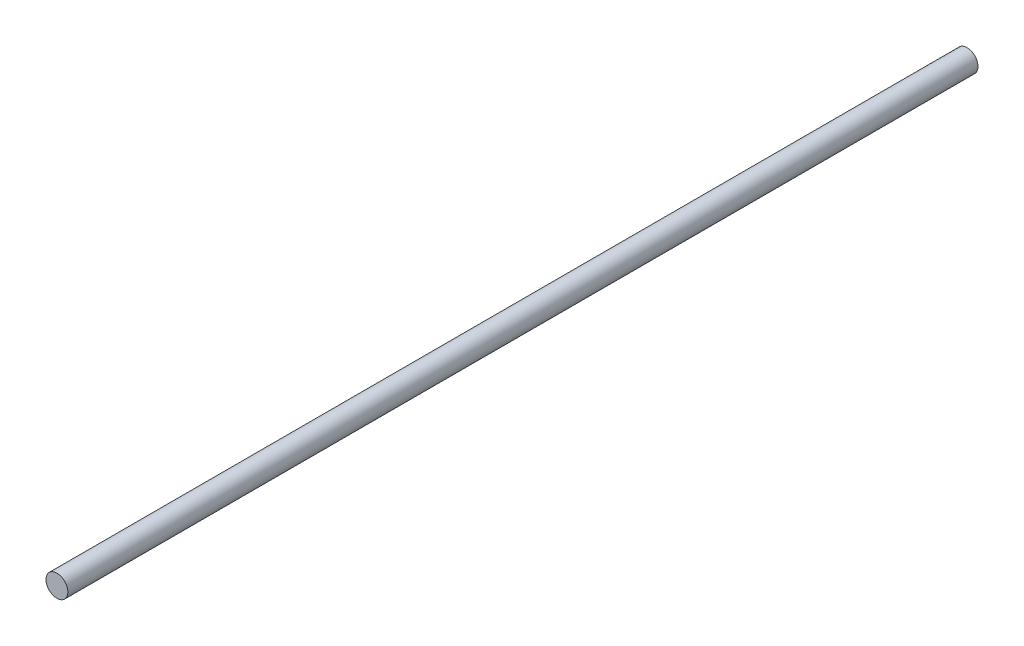
ISO-10303-21;
HEADER;
FILE_DESCRIPTION(('STEP AP214'),'2;1');
FILE_NAME('part.step','',(''),(''),'','','');
FILE_SCHEMA(('AUTOMOTIVE_DESIGN { 1 0 10303 214 1 1 1 1 }'));
ENDSEC;
DATA;
#1=APPLICATION_CONTEXT('core data for automotive mechanical design processes');
#2=APPLICATION_PROTOCOL_DEFINITION('international standard','automotive_design',2000,#1);
#3=PRODUCT_CONTEXT('',#1,'mechanical');
#4=PRODUCT('Part','Part','',(#3));
#5=PRODUCT_RELATED_PRODUCT_CATEGORY('part','',(#4));
#6=PRODUCT_DEFINITION_FORMATION('','',#4);
#7=PRODUCT_DEFINITION_CONTEXT('part definition',#1,'design');
#8=PRODUCT_DEFINITION('design','',#6,#7);
#9=PRODUCT_DEFINITION_SHAPE('','',#8);
#10=(LENGTH_UNIT() NAMED_UNIT(*) SI_UNIT(.MILLI.,.METRE.));
#11=(NAMED_UNIT(*) PLANE_ANGLE_UNIT() SI_UNIT($,.RADIAN.));
#12=(NAMED_UNIT(*) SI_UNIT($,.STERADIAN.) SOLID_ANGLE_UNIT());
#13=UNCERTAINTY_MEASURE_WITH_UNIT(LENGTH_MEASURE(1.E-05),#10,'distance_accuracy_value','');
#14=(GEOMETRIC_REPRESENTATION_CONTEXT(3) GLOBAL_UNCERTAINTY_ASSIGNED_CONTEXT((#13)) GLOBAL_UNIT_ASSIGNED_CONTEXT((#10,
#11,#12)) REPRESENTATION_CONTEXT('',''));
#15=CARTESIAN_POINT('',(0.,0.,0.));
#16=DIRECTION('',(0.,0.,1.));
#17=DIRECTION('',(1.,0.,0.));
#18=AXIS2_PLACEMENT_3D('',#15,#16,#17);
#19=CARTESIAN_POINT('',(0.,0.,125.));
#20=DIRECTION('',(0.,0.,-1.));
#21=DIRECTION('',(-1.,0.,0.));
#22=AXIS2_PLACEMENT_3D('',#19,#20,#21);
#23=CYLINDRICAL_SURFACE('',#22,3.);
#24=CARTESIAN_POINT('',(0.,0.,125.));
#25=DIRECTION('',(0.,0.,1.));
#26=DIRECTION('',(1.,0.,0.));
#27=AXIS2_PLACEMENT_3D('',#24,#25,#26);
#28=CIRCLE('',#27,3.);
#29=CARTESIAN_POINT('',(3.,0.,125.));
#30=VERTEX_POINT('',#29);
#31=EDGE_CURVE('E10',#30,#30,#28,.T.);
#32=ORIENTED_EDGE('',*,*,#31,.F.);
#33=EDGE_LOOP('',(#32));
#34=FACE_BOUND('',#33,.T.);
#35=CARTESIAN_POINT('',(0.,0.,-125.));
#36=DIRECTION('',(0.,0.,1.));
#37=DIRECTION('',(1.,0.,0.));
#38=AXIS2_PLACEMENT_3D('',#35,#36,#37);
#39=CIRCLE('',#38,3.);
#40=CARTESIAN_POINT('',(3.,0.,-125.));
#41=VERTEX_POINT('',#40);
#42=EDGE_CURVE('E35',#41,#41,#39,.T.);
#43=ORIENTED_EDGE('',*,*,#42,.T.);
#44=EDGE_LOOP('',(#43));
#45=FACE_BOUND('',#44,.T.);
#46=ADVANCED_FACE('F32',(#34,#45),#23,.T.);
#47=CARTESIAN_POINT('',(0.,0.,125.));
#48=DIRECTION('',(0.,0.,1.));
#49=DIRECTION('',(1.,0.,0.));
#50=AXIS2_PLACEMENT_3D('',#47,#48,#49);
#51=PLANE('',#50);
#52=ORIENTED_EDGE('',*,*,#31,.T.);
#53=EDGE_LOOP('',(#52));
#54=FACE_BOUND('',#53,.T.);
#55=ADVANCED_FACE('F47',(#54),#51,.T.);
#56=CARTESIAN_POINT('',(0.,0.,-125.));
#57=DIRECTION('',(0.,0.,1.));
#58=DIRECTION('',(1.,0.,0.));
#59=AXIS2_PLACEMENT_3D('',#56,#57,#58);
#60=PLANE('',#59);
#61=ORIENTED_EDGE('',*,*,#42,.F.);
#62=EDGE_LOOP('',(#61));
#63=FACE_BOUND('',#62,.T.);
#64=ADVANCED_FACE('F45',(#63),#60,.F.);
#65=CLOSED_SHELL('',(#46,#55,#64));
#66=MANIFOLD_SOLID_BREP('B2',#65);
#67=ADVANCED_BREP_SHAPE_REPRESENTATION('',(#18,#66),#14);
#68=SHAPE_DEFINITION_REPRESENTATION(#9,#67);
ENDSEC;
END-ISO-10303-21;
